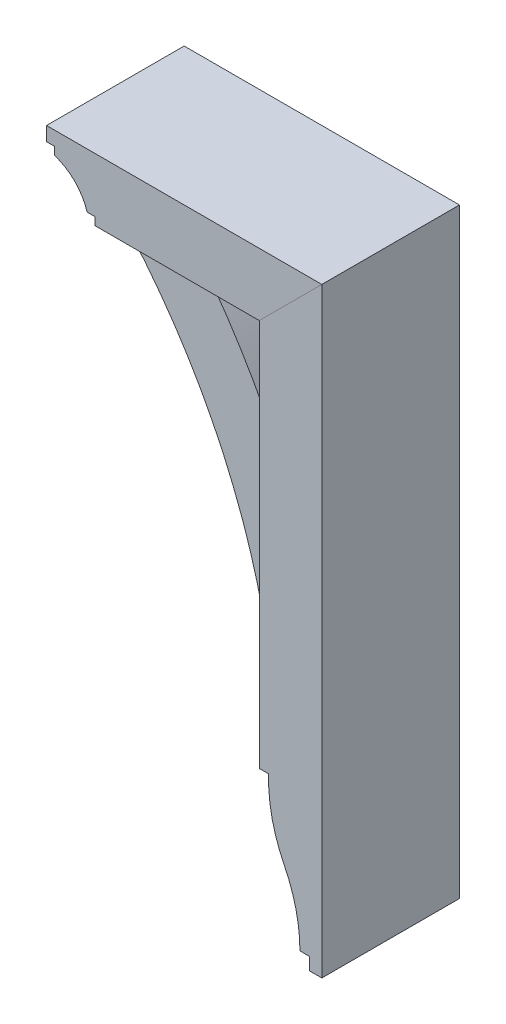
ISO-10303-21;
HEADER;
FILE_DESCRIPTION(('STEP AP214'),'2;1');
FILE_NAME('part.step','',(''),(''),'','','');
FILE_SCHEMA(('AUTOMOTIVE_DESIGN { 1 0 10303 214 1 1 1 1 }'));
ENDSEC;
DATA;
#1=APPLICATION_CONTEXT('core data for automotive mechanical design processes');
#2=APPLICATION_PROTOCOL_DEFINITION('international standard','automotive_design',2000,#1);
#3=PRODUCT_CONTEXT('',#1,'mechanical');
#4=PRODUCT('Part','Part','',(#3));
#5=PRODUCT_RELATED_PRODUCT_CATEGORY('part','',(#4));
#6=PRODUCT_DEFINITION_FORMATION('','',#4);
#7=PRODUCT_DEFINITION_CONTEXT('part definition',#1,'design');
#8=PRODUCT_DEFINITION('design','',#6,#7);
#9=PRODUCT_DEFINITION_SHAPE('','',#8);
#10=(LENGTH_UNIT() NAMED_UNIT(*) SI_UNIT(.MILLI.,.METRE.));
#11=(NAMED_UNIT(*) PLANE_ANGLE_UNIT() SI_UNIT($,.RADIAN.));
#12=(NAMED_UNIT(*) SI_UNIT($,.STERADIAN.) SOLID_ANGLE_UNIT());
#13=UNCERTAINTY_MEASURE_WITH_UNIT(LENGTH_MEASURE(1.E-05),#10,'distance_accuracy_value','');
#14=(GEOMETRIC_REPRESENTATION_CONTEXT(3) GLOBAL_UNCERTAINTY_ASSIGNED_CONTEXT((#13)) GLOBAL_UNIT_ASSIGNED_CONTEXT((#10,
#11,#12)) REPRESENTATION_CONTEXT('',''));
#15=CARTESIAN_POINT('',(0.,0.,0.));
#16=DIRECTION('',(0.,0.,1.));
#17=DIRECTION('',(1.,0.,0.));
#18=AXIS2_PLACEMENT_3D('',#15,#16,#17);
#19=CARTESIAN_POINT('',(0.,-183.515,69.85));
#20=DIRECTION('',(0.,1.,0.));
#21=DIRECTION('',(0.,0.,1.));
#22=AXIS2_PLACEMENT_3D('',#19,#20,#21);
#23=PLANE('',#22);
#24=DIRECTION('',(1.,0.,0.));
#25=VECTOR('',#24,1.);
#26=CARTESIAN_POINT('',(0.,-183.515,-69.85));
#27=LINE('',#26,#25);
#28=CARTESIAN_POINT('',(234.181223015556,-183.515,-69.85));
#29=VERTEX_POINT('',#28);
#30=CARTESIAN_POINT('',(243.706223015556,-183.515,-69.85));
#31=VERTEX_POINT('',#30);
#32=EDGE_CURVE('E170',#29,#31,#27,.T.);
#33=ORIENTED_EDGE('',*,*,#32,.T.);
#34=DIRECTION('',(0.,0.,-1.));
#35=VECTOR('',#34,1.);
#36=CARTESIAN_POINT('',(243.706223015556,-183.515,69.85));
#37=LINE('',#36,#35);
#38=CARTESIAN_POINT('',(243.706223015556,-183.515,69.85));
#39=VERTEX_POINT('',#38);
#40=EDGE_CURVE('E12',#39,#31,#37,.T.);
#41=ORIENTED_EDGE('',*,*,#40,.F.);
#42=DIRECTION('',(1.,0.,0.));
#43=VECTOR('',#42,1.);
#44=CARTESIAN_POINT('',(0.,-183.515,69.85));
#45=LINE('',#44,#43);
#46=CARTESIAN_POINT('',(234.181223015556,-183.515,69.85));
#47=VERTEX_POINT('',#46);
#48=EDGE_CURVE('E199',#47,#39,#45,.T.);
#49=ORIENTED_EDGE('',*,*,#48,.F.);
#50=DIRECTION('',(0.,0.,-1.));
#51=VECTOR('',#50,1.);
#52=CARTESIAN_POINT('',(234.181223015556,-183.515,69.85));
#53=LINE('',#52,#51);
#54=EDGE_CURVE('E166',#47,#29,#53,.T.);
#55=ORIENTED_EDGE('',*,*,#54,.T.);
#56=EDGE_LOOP('',(#33,#41,#49,#55));
#57=FACE_BOUND('',#56,.T.);
#58=ADVANCED_FACE('F60',(#57),#23,.F.);
#59=CARTESIAN_POINT('',(394.441019302061,-188.355593426,69.85));
#60=DIRECTION('',(0.,0.,-1.));
#61=DIRECTION('',(-1.,0.,0.));
#62=AXIS2_PLACEMENT_3D('',#59,#60,#61);
#63=CYLINDRICAL_SURFACE('',#62,150.8125);
#64=CARTESIAN_POINT('',(394.441019302061,-188.355593426,-69.85));
#65=DIRECTION('',(0.,0.,1.));
#66=DIRECTION('',(1.,0.,0.));
#67=AXIS2_PLACEMENT_3D('',#64,#65,#66);
#68=CIRCLE('',#67,150.8125);
#69=CARTESIAN_POINT('',(259.542371158808,-255.785296713,-69.85));
#70=VERTEX_POINT('',#69);
#71=EDGE_CURVE('E174',#31,#70,#68,.T.);
#72=ORIENTED_EDGE('',*,*,#71,.T.);
#73=DIRECTION('',(0.,0.,-1.));
#74=VECTOR('',#73,1.);
#75=CARTESIAN_POINT('',(259.542371158808,-255.785296713,69.85));
#76=LINE('',#75,#74);
#77=CARTESIAN_POINT('',(259.542371158808,-255.785296713,69.85));
#78=VERTEX_POINT('',#77);
#79=EDGE_CURVE('E69',#78,#70,#76,.T.);
#80=ORIENTED_EDGE('',*,*,#79,.F.);
#81=CARTESIAN_POINT('',(394.441019302061,-188.355593426,69.85));
#82=DIRECTION('',(0.,0.,1.));
#83=DIRECTION('',(1.,0.,0.));
#84=AXIS2_PLACEMENT_3D('',#81,#82,#83);
#85=CIRCLE('',#84,150.8125);
#86=EDGE_CURVE('E123',#39,#78,#85,.T.);
#87=ORIENTED_EDGE('',*,*,#86,.F.);
#88=ORIENTED_EDGE('',*,*,#40,.T.);
#89=EDGE_LOOP('',(#72,#80,#87,#88));
#90=FACE_BOUND('',#89,.T.);
#91=ADVANCED_FACE('F222',(#90),#63,.T.);
#92=CARTESIAN_POINT('',(124.643723015555,-323.215,69.85));
#93=DIRECTION('',(0.,0.,-1.));
#94=DIRECTION('',(-1.,0.,0.));
#95=AXIS2_PLACEMENT_3D('',#92,#93,#94);
#96=CYLINDRICAL_SURFACE('',#95,150.8125);
#97=CARTESIAN_POINT('',(124.643723015555,-323.215,-69.85));
#98=DIRECTION('',(0.,0.,1.));
#99=DIRECTION('',(1.,0.,0.));
#100=AXIS2_PLACEMENT_3D('',#97,#98,#99);
#101=CIRCLE('',#100,150.8125);
#102=CARTESIAN_POINT('',(275.456223015555,-323.215,-69.85));
#103=VERTEX_POINT('',#102);
#104=EDGE_CURVE('E177',#103,#70,#101,.T.);
#105=ORIENTED_EDGE('',*,*,#104,.F.);
#106=DIRECTION('',(0.,0.,-1.));
#107=VECTOR('',#106,1.);
#108=CARTESIAN_POINT('',(275.456223015555,-323.215,69.85));
#109=LINE('',#108,#107);
#110=CARTESIAN_POINT('',(275.456223015555,-323.215,69.85));
#111=VERTEX_POINT('',#110);
#112=EDGE_CURVE('E212',#111,#103,#109,.T.);
#113=ORIENTED_EDGE('',*,*,#112,.F.);
#114=CARTESIAN_POINT('',(124.643723015555,-323.215,69.85));
#115=DIRECTION('',(0.,0.,1.));
#116=DIRECTION('',(1.,0.,0.));
#117=AXIS2_PLACEMENT_3D('',#114,#115,#116);
#118=CIRCLE('',#117,150.8125);
#119=EDGE_CURVE('E221',#111,#78,#118,.T.);
#120=ORIENTED_EDGE('',*,*,#119,.T.);
#121=ORIENTED_EDGE('',*,*,#79,.T.);
#122=EDGE_LOOP('',(#105,#113,#120,#121));
#123=FACE_BOUND('',#122,.T.);
#124=ADVANCED_FACE('F219',(#123),#96,.F.);
#125=CARTESIAN_POINT('',(1.88367839844736E-12,-323.215000000002,69.85));
#126=DIRECTION('',(0.,-1.,0.));
#127=DIRECTION('',(1.,0.,0.));
#128=AXIS2_PLACEMENT_3D('',#125,#126,#127);
#129=PLANE('',#128);
#130=DIRECTION('',(-1.,0.,0.));
#131=VECTOR('',#130,1.);
#132=CARTESIAN_POINT('',(1.88367839844736E-12,-323.215000000002,-69.85));
#133=LINE('',#132,#131);
#134=CARTESIAN_POINT('',(284.981223015555,-323.215,-69.85));
#135=VERTEX_POINT('',#134);
#136=EDGE_CURVE('E181',#135,#103,#133,.T.);
#137=ORIENTED_EDGE('',*,*,#136,.F.);
#138=DIRECTION('',(0.,0.,-1.));
#139=VECTOR('',#138,1.);
#140=CARTESIAN_POINT('',(284.981223015555,-323.215,69.85));
#141=LINE('',#140,#139);
#142=CARTESIAN_POINT('',(284.981223015555,-323.215,69.85));
#143=VERTEX_POINT('',#142);
#144=EDGE_CURVE('E209',#143,#135,#141,.T.);
#145=ORIENTED_EDGE('',*,*,#144,.F.);
#146=DIRECTION('',(-1.,0.,0.));
#147=VECTOR('',#146,1.);
#148=CARTESIAN_POINT('',(1.88367839844736E-12,-323.215000000002,69.85));
#149=LINE('',#148,#147);
#150=EDGE_CURVE('E233',#143,#111,#149,.T.);
#151=ORIENTED_EDGE('',*,*,#150,.T.);
#152=ORIENTED_EDGE('',*,*,#112,.T.);
#153=EDGE_LOOP('',(#137,#145,#151,#152));
#154=FACE_BOUND('',#153,.T.);
#155=ADVANCED_FACE('F230',(#154),#129,.T.);
#156=CARTESIAN_POINT('',(284.981223015555,0.,69.85));
#157=DIRECTION('',(-1.,0.,0.));
#158=DIRECTION('',(0.,0.,1.));
#159=AXIS2_PLACEMENT_3D('',#156,#157,#158);
#160=PLANE('',#159);
#161=DIRECTION('',(0.,1.,0.));
#162=VECTOR('',#161,1.);
#163=CARTESIAN_POINT('',(284.981223015555,0.,-69.85));
#164=LINE('',#163,#162);
#165=CARTESIAN_POINT('',(284.981223015555,-335.915,-69.85));
#166=VERTEX_POINT('',#165);
#167=EDGE_CURVE('E185',#166,#135,#164,.T.);
#168=ORIENTED_EDGE('',*,*,#167,.F.);
#169=DIRECTION('',(0.,0.,-1.));
#170=VECTOR('',#169,1.);
#171=CARTESIAN_POINT('',(284.981223015555,-335.915,69.85));
#172=LINE('',#171,#170);
#173=CARTESIAN_POINT('',(284.981223015555,-335.915,69.85));
#174=VERTEX_POINT('',#173);
#175=EDGE_CURVE('E206',#174,#166,#172,.T.);
#176=ORIENTED_EDGE('',*,*,#175,.F.);
#177=DIRECTION('',(0.,1.,0.));
#178=VECTOR('',#177,1.);
#179=CARTESIAN_POINT('',(284.981223015555,0.,69.85));
#180=LINE('',#179,#178);
#181=EDGE_CURVE('E240',#174,#143,#180,.T.);
#182=ORIENTED_EDGE('',*,*,#181,.T.);
#183=ORIENTED_EDGE('',*,*,#144,.T.);
#184=EDGE_LOOP('',(#168,#176,#182,#183));
#185=FACE_BOUND('',#184,.T.);
#186=ADVANCED_FACE('F273',(#185),#160,.T.);
#187=CARTESIAN_POINT('',(0.,-335.915,69.85));
#188=DIRECTION('',(0.,-1.,0.));
#189=DIRECTION('',(0.,0.,-1.));
#190=AXIS2_PLACEMENT_3D('',#187,#188,#189);
#191=PLANE('',#190);
#192=DIRECTION('',(-1.,0.,0.));
#193=VECTOR('',#192,1.);
#194=CARTESIAN_POINT('',(0.,-335.915,-69.85));
#195=LINE('',#194,#193);
#196=CARTESIAN_POINT('',(297.681223015555,-335.915,-69.85));
#197=VERTEX_POINT('',#196);
#198=EDGE_CURVE('E189',#197,#166,#195,.T.);
#199=ORIENTED_EDGE('',*,*,#198,.F.);
#200=DIRECTION('',(0.,0.,-1.));
#201=VECTOR('',#200,1.);
#202=CARTESIAN_POINT('',(297.681223015555,-335.915,69.85));
#203=LINE('',#202,#201);
#204=CARTESIAN_POINT('',(297.681223015555,-335.915,69.85));
#205=VERTEX_POINT('',#204);
#206=EDGE_CURVE('E156',#205,#197,#203,.T.);
#207=ORIENTED_EDGE('',*,*,#206,.F.);
#208=DIRECTION('',(-1.,0.,0.));
#209=VECTOR('',#208,1.);
#210=CARTESIAN_POINT('',(0.,-335.915,69.85));
#211=LINE('',#210,#209);
#212=EDGE_CURVE('E147',#205,#174,#211,.T.);
#213=ORIENTED_EDGE('',*,*,#212,.T.);
#214=ORIENTED_EDGE('',*,*,#175,.T.);
#215=EDGE_LOOP('',(#199,#207,#213,#214));
#216=FACE_BOUND('',#215,.T.);
#217=ADVANCED_FACE('F249',(#216),#191,.T.);
#218=CARTESIAN_POINT('',(297.681223015555,0.,69.85));
#219=DIRECTION('',(-1.,0.,0.));
#220=DIRECTION('',(0.,-1.,0.));
#221=AXIS2_PLACEMENT_3D('',#218,#219,#220);
#222=PLANE('',#221);
#223=DIRECTION('',(0.,1.,0.));
#224=VECTOR('',#223,1.);
#225=CARTESIAN_POINT('',(297.681223015555,0.,-69.85));
#226=LINE('',#225,#224);
#227=CARTESIAN_POINT('',(297.681223015555,273.685,-69.85));
#228=VERTEX_POINT('',#227);
#229=EDGE_CURVE('E154',#197,#228,#226,.T.);
#230=ORIENTED_EDGE('',*,*,#229,.T.);
#231=DIRECTION('',(0.,0.,-1.));
#232=VECTOR('',#231,1.);
#233=CARTESIAN_POINT('',(297.681223015555,273.685,69.85));
#234=LINE('',#233,#232);
#235=CARTESIAN_POINT('',(297.681223015555,273.685,69.85));
#236=VERTEX_POINT('',#235);
#237=EDGE_CURVE('E151',#236,#228,#234,.T.);
#238=ORIENTED_EDGE('',*,*,#237,.F.);
#239=DIRECTION('',(0.,1.,0.));
#240=VECTOR('',#239,1.);
#241=CARTESIAN_POINT('',(297.681223015555,0.,69.85));
#242=LINE('',#241,#240);
#243=EDGE_CURVE('E140',#205,#236,#242,.T.);
#244=ORIENTED_EDGE('',*,*,#243,.F.);
#245=ORIENTED_EDGE('',*,*,#206,.T.);
#246=EDGE_LOOP('',(#230,#238,#244,#245));
#247=FACE_BOUND('',#246,.T.);
#248=ADVANCED_FACE('F152',(#247),#222,.F.);
#249=CARTESIAN_POINT('',(11.9981115077795,-11.9981115077793,69.85));
#250=DIRECTION('',(0.707106781186552,-0.707106781186543,0.));
#251=DIRECTION('',(0.707106781186543,0.707106781186552,0.));
#252=AXIS2_PLACEMENT_3D('',#249,#250,#251);
#253=PLANE('',#252);
#254=DIRECTION('',(-0.707106781186543,-0.707106781186552,0.));
#255=VECTOR('',#254,1.);
#256=CARTESIAN_POINT('',(11.9981115077795,-11.9981115077793,-69.85));
#257=LINE('',#256,#255);
#258=CARTESIAN_POINT('',(234.181223015556,210.185,-69.85));
#259=VERTEX_POINT('',#258);
#260=EDGE_CURVE('E109',#228,#259,#257,.T.);
#261=ORIENTED_EDGE('',*,*,#260,.T.);
#262=DIRECTION('',(0.,0.,-1.));
#263=VECTOR('',#262,1.);
#264=CARTESIAN_POINT('',(234.181223015556,210.185,69.85));
#265=LINE('',#264,#263);
#266=CARTESIAN_POINT('',(234.181223015556,210.185,69.85));
#267=VERTEX_POINT('',#266);
#268=EDGE_CURVE('E157',#267,#259,#265,.T.);
#269=ORIENTED_EDGE('',*,*,#268,.F.);
#270=DIRECTION('',(-0.707106781186543,-0.707106781186552,0.));
#271=VECTOR('',#270,1.);
#272=CARTESIAN_POINT('',(11.9981115077795,-11.9981115077793,69.85));
#273=LINE('',#272,#271);
#274=EDGE_CURVE('E144',#236,#267,#273,.T.);
#275=ORIENTED_EDGE('',*,*,#274,.F.);
#276=ORIENTED_EDGE('',*,*,#237,.T.);
#277=EDGE_LOOP('',(#261,#269,#275,#276));
#278=FACE_BOUND('',#277,.T.);
#279=ADVANCED_FACE('F159',(#278),#253,.F.);
#280=CARTESIAN_POINT('',(234.181223015556,0.,69.85));
#281=DIRECTION('',(1.,0.,0.));
#282=DIRECTION('',(0.,1.,0.));
#283=AXIS2_PLACEMENT_3D('',#280,#281,#282);
#284=PLANE('',#283);
#285=DIRECTION('',(0.,-1.,0.));
#286=VECTOR('',#285,1.);
#287=CARTESIAN_POINT('',(234.181223015556,0.,-69.85));
#288=LINE('',#287,#286);
#289=EDGE_CURVE('E115',#259,#29,#288,.T.);
#290=ORIENTED_EDGE('',*,*,#289,.T.);
#291=ORIENTED_EDGE('',*,*,#54,.F.);
#292=DIRECTION('',(0.,-1.,0.));
#293=VECTOR('',#292,1.);
#294=CARTESIAN_POINT('',(234.181223015556,0.,69.85));
#295=LINE('',#294,#293);
#296=EDGE_CURVE('E77',#267,#47,#295,.T.);
#297=ORIENTED_EDGE('',*,*,#296,.F.);
#298=ORIENTED_EDGE('',*,*,#268,.T.);
#299=EDGE_LOOP('',(#290,#291,#297,#298));
#300=FACE_BOUND('',#299,.T.);
#301=ADVANCED_FACE('F252',(#300),#284,.F.);
#302=CARTESIAN_POINT('',(0.,0.,69.85));
#303=DIRECTION('',(0.,0.,1.));
#304=DIRECTION('',(1.,0.,0.));
#305=AXIS2_PLACEMENT_3D('',#302,#303,#304);
#306=PLANE('',#305);
#307=ORIENTED_EDGE('',*,*,#48,.T.);
#308=ORIENTED_EDGE('',*,*,#86,.T.);
#309=ORIENTED_EDGE('',*,*,#119,.F.);
#310=ORIENTED_EDGE('',*,*,#150,.F.);
#311=ORIENTED_EDGE('',*,*,#181,.F.);
#312=ORIENTED_EDGE('',*,*,#212,.F.);
#313=ORIENTED_EDGE('',*,*,#243,.T.);
#314=ORIENTED_EDGE('',*,*,#274,.T.);
#315=ORIENTED_EDGE('',*,*,#296,.T.);
#316=EDGE_LOOP('',(#307,#308,#309,#310,#311,#312,#313,#314,#315));
#317=FACE_BOUND('',#316,.T.);
#318=ADVANCED_FACE('F142',(#317),#306,.T.);
#319=CARTESIAN_POINT('',(0.,0.,-69.85));
#320=DIRECTION('',(0.,0.,1.));
#321=DIRECTION('',(1.,0.,0.));
#322=AXIS2_PLACEMENT_3D('',#319,#320,#321);
#323=PLANE('',#322);
#324=ORIENTED_EDGE('',*,*,#32,.F.);
#325=ORIENTED_EDGE('',*,*,#289,.F.);
#326=ORIENTED_EDGE('',*,*,#260,.F.);
#327=ORIENTED_EDGE('',*,*,#229,.F.);
#328=ORIENTED_EDGE('',*,*,#198,.T.);
#329=ORIENTED_EDGE('',*,*,#167,.T.);
#330=ORIENTED_EDGE('',*,*,#136,.T.);
#331=ORIENTED_EDGE('',*,*,#104,.T.);
#332=ORIENTED_EDGE('',*,*,#71,.F.);
#333=EDGE_LOOP('',(#324,#325,#326,#327,#328,#329,#330,#331,#332));
#334=FACE_BOUND('',#333,.T.);
#335=ADVANCED_FACE('F226',(#334),#323,.F.);
#336=CLOSED_SHELL('',(#58,#91,#124,#155,#186,#217,#248,#279,#301,#318,#335));
#337=MANIFOLD_SOLID_BREP('B2',#336);
#338=CARTESIAN_POINT('',(-384.388411736873,-203.674659633313,44.45));
#339=DIRECTION('',(0.,0.,-1.));
#340=DIRECTION('',(-1.,0.,0.));
#341=AXIS2_PLACEMENT_3D('',#338,#339,#340);
#342=CYLINDRICAL_SURFACE('',#341,674.6875);
#343=CARTESIAN_POINT('',(-384.388411736873,-203.674659633313,-44.45));
#344=DIRECTION('',(0.,0.,1.));
#345=DIRECTION('',(1.,0.,0.));
#346=AXIS2_PLACEMENT_3D('',#343,#344,#345);
#347=CIRCLE('',#346,674.6875);
#348=CARTESIAN_POINT('',(148.456223015555,210.185,-44.45));
#349=VERTEX_POINT('',#348);
#350=CARTESIAN_POINT('',(234.181223015556,65.7224999999997,-44.45));
#351=VERTEX_POINT('',#350);
#352=EDGE_CURVE('E487',#349,#351,#347,.F.);
#353=ORIENTED_EDGE('',*,*,#352,.F.);
#354=DIRECTION('',(0.,0.,-1.));
#355=VECTOR('',#354,1.);
#356=CARTESIAN_POINT('',(148.456223015555,210.185,44.45));
#357=LINE('',#356,#355);
#358=CARTESIAN_POINT('',(148.456223015555,210.185,44.45));
#359=VERTEX_POINT('',#358);
#360=EDGE_CURVE('E58',#359,#349,#357,.T.);
#361=ORIENTED_EDGE('',*,*,#360,.F.);
#362=CARTESIAN_POINT('',(-384.388411736873,-203.674659633313,44.45));
#363=DIRECTION('',(0.,0.,1.));
#364=DIRECTION('',(1.,0.,0.));
#365=AXIS2_PLACEMENT_3D('',#362,#363,#364);
#366=CIRCLE('',#365,674.6875);
#367=CARTESIAN_POINT('',(234.181223015556,65.7224999999997,44.45));
#368=VERTEX_POINT('',#367);
#369=EDGE_CURVE('E506',#359,#368,#366,.F.);
#370=ORIENTED_EDGE('',*,*,#369,.T.);
#371=DIRECTION('',(0.,0.,-1.));
#372=VECTOR('',#371,1.);
#373=CARTESIAN_POINT('',(234.181223015556,65.7224999999997,44.45));
#374=LINE('',#373,#372);
#375=EDGE_CURVE('E416',#368,#351,#374,.T.);
#376=ORIENTED_EDGE('',*,*,#375,.T.);
#377=EDGE_LOOP('',(#353,#361,#370,#376));
#378=FACE_BOUND('',#377,.T.);
#379=ADVANCED_FACE('F399',(#378),#342,.T.);
#380=CARTESIAN_POINT('',(-1.04995377471693E-13,210.185,44.45));
#381=DIRECTION('',(0.,1.,0.));
#382=DIRECTION('',(-1.,0.,0.));
#383=AXIS2_PLACEMENT_3D('',#380,#381,#382);
#384=PLANE('',#383);
#385=DIRECTION('',(1.,0.,0.));
#386=VECTOR('',#385,1.);
#387=CARTESIAN_POINT('',(-1.04995377471693E-13,210.185,-44.45));
#388=LINE('',#387,#386);
#389=CARTESIAN_POINT('',(77.018723015555,210.185,-44.45));
#390=VERTEX_POINT('',#389);
#391=EDGE_CURVE('E490',#390,#349,#388,.T.);
#392=ORIENTED_EDGE('',*,*,#391,.F.);
#393=DIRECTION('',(0.,0.,-1.));
#394=VECTOR('',#393,1.);
#395=CARTESIAN_POINT('',(77.018723015555,210.185,44.45));
#396=LINE('',#395,#394);
#397=CARTESIAN_POINT('',(77.018723015555,210.185,44.45));
#398=VERTEX_POINT('',#397);
#399=EDGE_CURVE('E408',#398,#390,#396,.T.);
#400=ORIENTED_EDGE('',*,*,#399,.F.);
#401=DIRECTION('',(1.,0.,0.));
#402=VECTOR('',#401,1.);
#403=CARTESIAN_POINT('',(-1.04995377471693E-13,210.185,44.45));
#404=LINE('',#403,#402);
#405=EDGE_CURVE('E522',#398,#359,#404,.T.);
#406=ORIENTED_EDGE('',*,*,#405,.T.);
#407=ORIENTED_EDGE('',*,*,#360,.T.);
#408=EDGE_LOOP('',(#392,#400,#406,#407));
#409=FACE_BOUND('',#408,.T.);
#410=ADVANCED_FACE('F521',(#409),#384,.T.);
#411=CARTESIAN_POINT('',(77.0187230155555,1.68322755155703E-13,44.45));
#412=DIRECTION('',(1.,0.,0.));
#413=DIRECTION('',(0.,1.,0.));
#414=AXIS2_PLACEMENT_3D('',#411,#412,#413);
#415=PLANE('',#414);
#416=DIRECTION('',(0.,-1.,0.));
#417=VECTOR('',#416,1.);
#418=CARTESIAN_POINT('',(77.0187230155555,1.68322755155703E-13,-44.45));
#419=LINE('',#418,#417);
#420=CARTESIAN_POINT('',(77.018723015555,197.485,-44.45));
#421=VERTEX_POINT('',#420);
#422=EDGE_CURVE('E494',#390,#421,#419,.T.);
#423=ORIENTED_EDGE('',*,*,#422,.T.);
#424=DIRECTION('',(0.,0.,-1.));
#425=VECTOR('',#424,1.);
#426=CARTESIAN_POINT('',(77.018723015555,197.485,44.45));
#427=LINE('',#426,#425);
#428=CARTESIAN_POINT('',(77.018723015555,197.485,44.45));
#429=VERTEX_POINT('',#428);
#430=EDGE_CURVE('E476',#429,#421,#427,.T.);
#431=ORIENTED_EDGE('',*,*,#430,.F.);
#432=DIRECTION('',(0.,-1.,0.));
#433=VECTOR('',#432,1.);
#434=CARTESIAN_POINT('',(77.0187230155555,1.68322755155703E-13,44.45));
#435=LINE('',#434,#433);
#436=EDGE_CURVE('E462',#398,#429,#435,.T.);
#437=ORIENTED_EDGE('',*,*,#436,.F.);
#438=ORIENTED_EDGE('',*,*,#399,.T.);
#439=EDGE_LOOP('',(#423,#431,#437,#438));
#440=FACE_BOUND('',#439,.T.);
#441=ADVANCED_FACE('F515',(#440),#415,.F.);
#442=CARTESIAN_POINT('',(-383.927755161358,-203.860866320497,44.45));
#443=DIRECTION('',(0.,0.,-1.));
#444=DIRECTION('',(-1.,0.,0.));
#445=AXIS2_PLACEMENT_3D('',#442,#443,#444);
#446=CYLINDRICAL_SURFACE('',#445,611.1875);
#447=CARTESIAN_POINT('',(-383.927755161358,-203.860866320497,-44.45));
#448=DIRECTION('',(0.,0.,1.));
#449=DIRECTION('',(1.,0.,0.));
#450=AXIS2_PLACEMENT_3D('',#447,#448,#449);
#451=CIRCLE('',#450,611.1875);
#452=CARTESIAN_POINT('',(221.481223015556,-120.015,-44.45));
#453=VERTEX_POINT('',#452);
#454=EDGE_CURVE('E472',#421,#453,#451,.F.);
#455=ORIENTED_EDGE('',*,*,#454,.T.);
#456=DIRECTION('',(0.,0.,-1.));
#457=VECTOR('',#456,1.);
#458=CARTESIAN_POINT('',(221.481223015556,-120.015,44.45));
#459=LINE('',#458,#457);
#460=CARTESIAN_POINT('',(221.481223015556,-120.015,44.45));
#461=VERTEX_POINT('',#460);
#462=EDGE_CURVE('E469',#461,#453,#459,.T.);
#463=ORIENTED_EDGE('',*,*,#462,.F.);
#464=CARTESIAN_POINT('',(-383.927755161358,-203.860866320497,44.45));
#465=DIRECTION('',(0.,0.,1.));
#466=DIRECTION('',(1.,0.,0.));
#467=AXIS2_PLACEMENT_3D('',#464,#465,#466);
#468=CIRCLE('',#467,611.1875);
#469=EDGE_CURVE('E454',#429,#461,#468,.F.);
#470=ORIENTED_EDGE('',*,*,#469,.F.);
#471=ORIENTED_EDGE('',*,*,#430,.T.);
#472=EDGE_LOOP('',(#455,#463,#470,#471));
#473=FACE_BOUND('',#472,.T.);
#474=ADVANCED_FACE('F470',(#473),#446,.F.);
#475=CARTESIAN_POINT('',(1.31145094783847E-13,-120.015,44.45));
#476=DIRECTION('',(0.,-1.,0.));
#477=DIRECTION('',(1.,0.,0.));
#478=AXIS2_PLACEMENT_3D('',#475,#476,#477);
#479=PLANE('',#478);
#480=DIRECTION('',(-1.,0.,0.));
#481=VECTOR('',#480,1.);
#482=CARTESIAN_POINT('',(1.31145094783847E-13,-120.015,-44.45));
#483=LINE('',#482,#481);
#484=CARTESIAN_POINT('',(234.181223015556,-120.015,-44.45));
#485=VERTEX_POINT('',#484);
#486=EDGE_CURVE('E499',#485,#453,#483,.T.);
#487=ORIENTED_EDGE('',*,*,#486,.F.);
#488=DIRECTION('',(0.,0.,-1.));
#489=VECTOR('',#488,1.);
#490=CARTESIAN_POINT('',(234.181223015556,-120.015,44.45));
#491=LINE('',#490,#489);
#492=CARTESIAN_POINT('',(234.181223015556,-120.015,44.45));
#493=VERTEX_POINT('',#492);
#494=EDGE_CURVE('E435',#493,#485,#491,.T.);
#495=ORIENTED_EDGE('',*,*,#494,.F.);
#496=DIRECTION('',(-1.,0.,0.));
#497=VECTOR('',#496,1.);
#498=CARTESIAN_POINT('',(1.31145094783847E-13,-120.015,44.45));
#499=LINE('',#498,#497);
#500=EDGE_CURVE('E459',#493,#461,#499,.T.);
#501=ORIENTED_EDGE('',*,*,#500,.T.);
#502=ORIENTED_EDGE('',*,*,#462,.T.);
#503=EDGE_LOOP('',(#487,#495,#501,#502));
#504=FACE_BOUND('',#503,.T.);
#505=ADVANCED_FACE('F478',(#504),#479,.T.);
#506=CARTESIAN_POINT('',(234.181223015556,0.,44.45));
#507=DIRECTION('',(1.,0.,0.));
#508=DIRECTION('',(0.,1.,0.));
#509=AXIS2_PLACEMENT_3D('',#506,#507,#508);
#510=PLANE('',#509);
#511=DIRECTION('',(0.,-1.,0.));
#512=VECTOR('',#511,1.);
#513=CARTESIAN_POINT('',(234.181223015556,0.,-44.45));
#514=LINE('',#513,#512);
#515=EDGE_CURVE('E502',#351,#485,#514,.T.);
#516=ORIENTED_EDGE('',*,*,#515,.F.);
#517=ORIENTED_EDGE('',*,*,#375,.F.);
#518=DIRECTION('',(0.,-1.,0.));
#519=VECTOR('',#518,1.);
#520=CARTESIAN_POINT('',(234.181223015556,0.,44.45));
#521=LINE('',#520,#519);
#522=EDGE_CURVE('E480',#368,#493,#521,.T.);
#523=ORIENTED_EDGE('',*,*,#522,.T.);
#524=ORIENTED_EDGE('',*,*,#494,.T.);
#525=EDGE_LOOP('',(#516,#517,#523,#524));
#526=FACE_BOUND('',#525,.T.);
#527=ADVANCED_FACE('F523',(#526),#510,.T.);
#528=CARTESIAN_POINT('',(0.,0.,44.45));
#529=DIRECTION('',(0.,0.,1.));
#530=DIRECTION('',(1.,0.,0.));
#531=AXIS2_PLACEMENT_3D('',#528,#529,#530);
#532=PLANE('',#531);
#533=ORIENTED_EDGE('',*,*,#369,.F.);
#534=ORIENTED_EDGE('',*,*,#405,.F.);
#535=ORIENTED_EDGE('',*,*,#436,.T.);
#536=ORIENTED_EDGE('',*,*,#469,.T.);
#537=ORIENTED_EDGE('',*,*,#500,.F.);
#538=ORIENTED_EDGE('',*,*,#522,.F.);
#539=EDGE_LOOP('',(#533,#534,#535,#536,#537,#538));
#540=FACE_BOUND('',#539,.T.);
#541=ADVANCED_FACE('F456',(#540),#532,.T.);
#542=CARTESIAN_POINT('',(0.,0.,-44.45));
#543=DIRECTION('',(0.,0.,1.));
#544=DIRECTION('',(1.,0.,0.));
#545=AXIS2_PLACEMENT_3D('',#542,#543,#544);
#546=PLANE('',#545);
#547=ORIENTED_EDGE('',*,*,#352,.T.);
#548=ORIENTED_EDGE('',*,*,#515,.T.);
#549=ORIENTED_EDGE('',*,*,#486,.T.);
#550=ORIENTED_EDGE('',*,*,#454,.F.);
#551=ORIENTED_EDGE('',*,*,#422,.F.);
#552=ORIENTED_EDGE('',*,*,#391,.T.);
#553=EDGE_LOOP('',(#547,#548,#549,#550,#551,#552));
#554=FACE_BOUND('',#553,.T.);
#555=ADVANCED_FACE('F520',(#554),#546,.F.);
#556=CLOSED_SHELL('',(#379,#410,#441,#474,#505,#527,#541,#555));
#557=MANIFOLD_SOLID_BREP('B6',#556);
#558=CARTESIAN_POINT('',(26.2187230155549,0.,69.85));
#559=DIRECTION('',(-1.,0.,0.));
#560=DIRECTION('',(0.,-1.,0.));
#561=AXIS2_PLACEMENT_3D('',#558,#559,#560);
#562=PLANE('',#561);
#563=DIRECTION('',(0.,1.,0.));
#564=VECTOR('',#563,1.);
#565=CARTESIAN_POINT('',(26.2187230155549,0.,-69.85));
#566=LINE('',#565,#564);
#567=CARTESIAN_POINT('',(26.218723015555,251.46,-69.85));
#568=VERTEX_POINT('',#567);
#569=CARTESIAN_POINT('',(26.218723015555,259.3975,-69.85));
#570=VERTEX_POINT('',#569);
#571=EDGE_CURVE('E714',#568,#570,#566,.T.);
#572=ORIENTED_EDGE('',*,*,#571,.F.);
#573=DIRECTION('',(0.,0.,-1.));
#574=VECTOR('',#573,1.);
#575=CARTESIAN_POINT('',(26.218723015555,251.46,69.85));
#576=LINE('',#575,#574);
#577=CARTESIAN_POINT('',(26.218723015555,251.46,69.85));
#578=VERTEX_POINT('',#577);
#579=EDGE_CURVE('E397',#578,#568,#576,.T.);
#580=ORIENTED_EDGE('',*,*,#579,.F.);
#581=DIRECTION('',(0.,1.,0.));
#582=VECTOR('',#581,1.);
#583=CARTESIAN_POINT('',(26.2187230155549,0.,69.85));
#584=LINE('',#583,#582);
#585=CARTESIAN_POINT('',(26.218723015555,259.3975,69.85));
#586=VERTEX_POINT('',#585);
#587=EDGE_CURVE('E746',#578,#586,#584,.T.);
#588=ORIENTED_EDGE('',*,*,#587,.T.);
#589=DIRECTION('',(0.,0.,-1.));
#590=VECTOR('',#589,1.);
#591=CARTESIAN_POINT('',(26.218723015555,259.3975,69.85));
#592=LINE('',#591,#590);
#593=EDGE_CURVE('E626',#586,#570,#592,.T.);
#594=ORIENTED_EDGE('',*,*,#593,.T.);
#595=EDGE_LOOP('',(#572,#580,#588,#594));
#596=FACE_BOUND('',#595,.T.);
#597=ADVANCED_FACE('F609',(#596),#562,.T.);
#598=CARTESIAN_POINT('',(11.1212597180008,203.025036702446,69.85));
#599=DIRECTION('',(0.,0.,-1.));
#600=DIRECTION('',(-1.,0.,0.));
#601=AXIS2_PLACEMENT_3D('',#598,#599,#600);
#602=CYLINDRICAL_SURFACE('',#601,50.7334117486338);
#603=CARTESIAN_POINT('',(11.1212597180008,203.025036702446,-69.85));
#604=DIRECTION('',(0.,0.,1.));
#605=DIRECTION('',(1.,0.,0.));
#606=AXIS2_PLACEMENT_3D('',#603,#604,#605);
#607=CIRCLE('',#606,50.7334117486338);
#608=CARTESIAN_POINT('',(59.556223015555,218.1225,-69.85));
#609=VERTEX_POINT('',#608);
#610=EDGE_CURVE('E717',#568,#609,#607,.F.);
#611=ORIENTED_EDGE('',*,*,#610,.T.);
#612=DIRECTION('',(0.,0.,-1.));
#613=VECTOR('',#612,1.);
#614=CARTESIAN_POINT('',(59.556223015555,218.1225,69.85));
#615=LINE('',#614,#613);
#616=CARTESIAN_POINT('',(59.556223015555,218.1225,69.85));
#617=VERTEX_POINT('',#616);
#618=EDGE_CURVE('E618',#617,#609,#615,.T.);
#619=ORIENTED_EDGE('',*,*,#618,.F.);
#620=CARTESIAN_POINT('',(11.1212597180008,203.025036702446,69.85));
#621=DIRECTION('',(0.,0.,1.));
#622=DIRECTION('',(1.,0.,0.));
#623=AXIS2_PLACEMENT_3D('',#620,#621,#622);
#624=CIRCLE('',#623,50.7334117486338);
#625=EDGE_CURVE('E781',#578,#617,#624,.F.);
#626=ORIENTED_EDGE('',*,*,#625,.F.);
#627=ORIENTED_EDGE('',*,*,#579,.T.);
#628=EDGE_LOOP('',(#611,#619,#626,#627));
#629=FACE_BOUND('',#628,.T.);
#630=ADVANCED_FACE('F770',(#629),#602,.F.);
#631=CARTESIAN_POINT('',(7.62723217917483E-13,218.1225,69.85));
#632=DIRECTION('',(0.,-1.,0.));
#633=DIRECTION('',(1.,0.,0.));
#634=AXIS2_PLACEMENT_3D('',#631,#632,#633);
#635=PLANE('',#634);
#636=DIRECTION('',(-1.,0.,0.));
#637=VECTOR('',#636,1.);
#638=CARTESIAN_POINT('',(7.62723217917483E-13,218.1225,-69.85));
#639=LINE('',#638,#637);
#640=CARTESIAN_POINT('',(67.493723015555,218.1225,-69.85));
#641=VERTEX_POINT('',#640);
#642=EDGE_CURVE('E721',#641,#609,#639,.T.);
#643=ORIENTED_EDGE('',*,*,#642,.F.);
#644=DIRECTION('',(0.,0.,-1.));
#645=VECTOR('',#644,1.);
#646=CARTESIAN_POINT('',(67.493723015555,218.1225,69.85));
#647=LINE('',#646,#645);
#648=CARTESIAN_POINT('',(67.493723015555,218.1225,69.85));
#649=VERTEX_POINT('',#648);
#650=EDGE_CURVE('E758',#649,#641,#647,.T.);
#651=ORIENTED_EDGE('',*,*,#650,.F.);
#652=DIRECTION('',(-1.,0.,0.));
#653=VECTOR('',#652,1.);
#654=CARTESIAN_POINT('',(7.62723217917483E-13,218.1225,69.85));
#655=LINE('',#654,#653);
#656=EDGE_CURVE('E767',#649,#617,#655,.T.);
#657=ORIENTED_EDGE('',*,*,#656,.T.);
#658=ORIENTED_EDGE('',*,*,#618,.T.);
#659=EDGE_LOOP('',(#643,#651,#657,#658));
#660=FACE_BOUND('',#659,.T.);
#661=ADVANCED_FACE('F765',(#660),#635,.T.);
#662=CARTESIAN_POINT('',(67.4937230155554,1.18004858755185E-13,69.85));
#663=DIRECTION('',(-1.,0.,0.));
#664=DIRECTION('',(0.,-1.,0.));
#665=AXIS2_PLACEMENT_3D('',#662,#663,#664);
#666=PLANE('',#665);
#667=DIRECTION('',(0.,1.,0.));
#668=VECTOR('',#667,1.);
#669=CARTESIAN_POINT('',(67.4937230155554,1.18004858755185E-13,-69.85));
#670=LINE('',#669,#668);
#671=CARTESIAN_POINT('',(67.493723015555,210.185,-69.85));
#672=VERTEX_POINT('',#671);
#673=EDGE_CURVE('E725',#672,#641,#670,.T.);
#674=ORIENTED_EDGE('',*,*,#673,.F.);
#675=DIRECTION('',(0.,0.,-1.));
#676=VECTOR('',#675,1.);
#677=CARTESIAN_POINT('',(67.493723015555,210.185,69.85));
#678=LINE('',#677,#676);
#679=CARTESIAN_POINT('',(67.493723015555,210.185,69.85));
#680=VERTEX_POINT('',#679);
#681=EDGE_CURVE('E756',#680,#672,#678,.T.);
#682=ORIENTED_EDGE('',*,*,#681,.F.);
#683=DIRECTION('',(0.,1.,0.));
#684=VECTOR('',#683,1.);
#685=CARTESIAN_POINT('',(67.4937230155554,1.18004858755185E-13,69.85));
#686=LINE('',#685,#684);
#687=EDGE_CURVE('E780',#680,#649,#686,.T.);
#688=ORIENTED_EDGE('',*,*,#687,.T.);
#689=ORIENTED_EDGE('',*,*,#650,.T.);
#690=EDGE_LOOP('',(#674,#682,#688,#689));
#691=FACE_BOUND('',#690,.T.);
#692=ADVANCED_FACE('F776',(#691),#666,.T.);
#693=CARTESIAN_POINT('',(-1.04995377471693E-13,210.185,69.85));
#694=DIRECTION('',(0.,1.,0.));
#695=DIRECTION('',(-1.,0.,0.));
#696=AXIS2_PLACEMENT_3D('',#693,#694,#695);
#697=PLANE('',#696);
#698=DIRECTION('',(1.,0.,0.));
#699=VECTOR('',#698,1.);
#700=CARTESIAN_POINT('',(-1.04995377471693E-13,210.185,-69.85));
#701=LINE('',#700,#699);
#702=CARTESIAN_POINT('',(234.181223015556,210.185,-69.85));
#703=VERTEX_POINT('',#702);
#704=EDGE_CURVE('E729',#672,#703,#701,.T.);
#705=ORIENTED_EDGE('',*,*,#704,.T.);
#706=DIRECTION('',(0.,0.,-1.));
#707=VECTOR('',#706,1.);
#708=CARTESIAN_POINT('',(234.181223015556,210.185,69.85));
#709=LINE('',#708,#707);
#710=CARTESIAN_POINT('',(234.181223015556,210.185,69.85));
#711=VERTEX_POINT('',#710);
#712=EDGE_CURVE('E753',#711,#703,#709,.T.);
#713=ORIENTED_EDGE('',*,*,#712,.F.);
#714=DIRECTION('',(1.,0.,0.));
#715=VECTOR('',#714,1.);
#716=CARTESIAN_POINT('',(-1.04995377471693E-13,210.185,69.85));
#717=LINE('',#716,#715);
#718=EDGE_CURVE('E786',#680,#711,#717,.T.);
#719=ORIENTED_EDGE('',*,*,#718,.F.);
#720=ORIENTED_EDGE('',*,*,#681,.T.);
#721=EDGE_LOOP('',(#705,#713,#719,#720));
#722=FACE_BOUND('',#721,.T.);
#723=ADVANCED_FACE('F818',(#722),#697,.F.);
#724=CARTESIAN_POINT('',(11.9981115077795,-11.9981115077793,69.85));
#725=DIRECTION('',(0.707106781186552,-0.707106781186543,0.));
#726=DIRECTION('',(0.707106781186543,0.707106781186552,0.));
#727=AXIS2_PLACEMENT_3D('',#724,#725,#726);
#728=PLANE('',#727);
#729=DIRECTION('',(-0.707106781186543,-0.707106781186552,0.));
#730=VECTOR('',#729,1.);
#731=CARTESIAN_POINT('',(11.9981115077795,-11.9981115077793,-69.85));
#732=LINE('',#731,#730);
#733=CARTESIAN_POINT('',(297.681223015555,273.685,-69.85));
#734=VERTEX_POINT('',#733);
#735=EDGE_CURVE('E733',#734,#703,#732,.T.);
#736=ORIENTED_EDGE('',*,*,#735,.F.);
#737=DIRECTION('',(0.,0.,-1.));
#738=VECTOR('',#737,1.);
#739=CARTESIAN_POINT('',(297.681223015555,273.685,69.85));
#740=LINE('',#739,#738);
#741=CARTESIAN_POINT('',(297.681223015555,273.685,69.85));
#742=VERTEX_POINT('',#741);
#743=EDGE_CURVE('E703',#742,#734,#740,.T.);
#744=ORIENTED_EDGE('',*,*,#743,.F.);
#745=DIRECTION('',(-0.707106781186543,-0.707106781186552,0.));
#746=VECTOR('',#745,1.);
#747=CARTESIAN_POINT('',(11.9981115077795,-11.9981115077793,69.85));
#748=LINE('',#747,#746);
#749=EDGE_CURVE('E691',#742,#711,#748,.T.);
#750=ORIENTED_EDGE('',*,*,#749,.T.);
#751=ORIENTED_EDGE('',*,*,#712,.T.);
#752=EDGE_LOOP('',(#736,#744,#750,#751));
#753=FACE_BOUND('',#752,.T.);
#754=ADVANCED_FACE('F795',(#753),#728,.T.);
#755=CARTESIAN_POINT('',(0.,273.685,69.85));
#756=DIRECTION('',(0.,-1.,0.));
#757=DIRECTION('',(0.,0.,-1.));
#758=AXIS2_PLACEMENT_3D('',#755,#756,#757);
#759=PLANE('',#758);
#760=DIRECTION('',(-1.,0.,0.));
#761=VECTOR('',#760,1.);
#762=CARTESIAN_POINT('',(0.,273.685,-69.85));
#763=LINE('',#762,#761);
#764=CARTESIAN_POINT('',(18.281223015555,273.685,-69.85));
#765=VERTEX_POINT('',#764);
#766=EDGE_CURVE('E699',#734,#765,#763,.T.);
#767=ORIENTED_EDGE('',*,*,#766,.T.);
#768=DIRECTION('',(0.,0.,-1.));
#769=VECTOR('',#768,1.);
#770=CARTESIAN_POINT('',(18.281223015555,273.685,69.85));
#771=LINE('',#770,#769);
#772=CARTESIAN_POINT('',(18.281223015555,273.685,69.85));
#773=VERTEX_POINT('',#772);
#774=EDGE_CURVE('E696',#773,#765,#771,.T.);
#775=ORIENTED_EDGE('',*,*,#774,.F.);
#776=DIRECTION('',(-1.,0.,0.));
#777=VECTOR('',#776,1.);
#778=CARTESIAN_POINT('',(0.,273.685,69.85));
#779=LINE('',#778,#777);
#780=EDGE_CURVE('E683',#742,#773,#779,.T.);
#781=ORIENTED_EDGE('',*,*,#780,.F.);
#782=ORIENTED_EDGE('',*,*,#743,.T.);
#783=EDGE_LOOP('',(#767,#775,#781,#782));
#784=FACE_BOUND('',#783,.T.);
#785=ADVANCED_FACE('F697',(#784),#759,.F.);
#786=CARTESIAN_POINT('',(18.281223015555,0.,69.85));
#787=DIRECTION('',(1.,0.,0.));
#788=DIRECTION('',(0.,0.,-1.));
#789=AXIS2_PLACEMENT_3D('',#786,#787,#788);
#790=PLANE('',#789);
#791=DIRECTION('',(0.,-1.,0.));
#792=VECTOR('',#791,1.);
#793=CARTESIAN_POINT('',(18.281223015555,0.,-69.85));
#794=LINE('',#793,#792);
#795=CARTESIAN_POINT('',(18.281223015555,259.3975,-69.85));
#796=VERTEX_POINT('',#795);
#797=EDGE_CURVE('E739',#765,#796,#794,.T.);
#798=ORIENTED_EDGE('',*,*,#797,.T.);
#799=DIRECTION('',(0.,0.,-1.));
#800=VECTOR('',#799,1.);
#801=CARTESIAN_POINT('',(18.281223015555,259.3975,69.85));
#802=LINE('',#801,#800);
#803=CARTESIAN_POINT('',(18.281223015555,259.3975,69.85));
#804=VERTEX_POINT('',#803);
#805=EDGE_CURVE('E655',#804,#796,#802,.T.);
#806=ORIENTED_EDGE('',*,*,#805,.F.);
#807=DIRECTION('',(0.,-1.,0.));
#808=VECTOR('',#807,1.);
#809=CARTESIAN_POINT('',(18.281223015555,0.,69.85));
#810=LINE('',#809,#808);
#811=EDGE_CURVE('E689',#773,#804,#810,.T.);
#812=ORIENTED_EDGE('',*,*,#811,.F.);
#813=ORIENTED_EDGE('',*,*,#774,.T.);
#814=EDGE_LOOP('',(#798,#806,#812,#813));
#815=FACE_BOUND('',#814,.T.);
#816=ADVANCED_FACE('F705',(#815),#790,.F.);
#817=CARTESIAN_POINT('',(0.,259.3975,69.85));
#818=DIRECTION('',(0.,-1.,0.));
#819=DIRECTION('',(0.,0.,-1.));
#820=AXIS2_PLACEMENT_3D('',#817,#818,#819);
#821=PLANE('',#820);
#822=DIRECTION('',(-1.,0.,0.));
#823=VECTOR('',#822,1.);
#824=CARTESIAN_POINT('',(0.,259.3975,-69.85));
#825=LINE('',#824,#823);
#826=EDGE_CURVE('E742',#570,#796,#825,.T.);
#827=ORIENTED_EDGE('',*,*,#826,.F.);
#828=ORIENTED_EDGE('',*,*,#593,.F.);
#829=DIRECTION('',(-1.,0.,0.));
#830=VECTOR('',#829,1.);
#831=CARTESIAN_POINT('',(0.,259.3975,69.85));
#832=LINE('',#831,#830);
#833=EDGE_CURVE('E707',#586,#804,#832,.T.);
#834=ORIENTED_EDGE('',*,*,#833,.T.);
#835=ORIENTED_EDGE('',*,*,#805,.T.);
#836=EDGE_LOOP('',(#827,#828,#834,#835));
#837=FACE_BOUND('',#836,.T.);
#838=ADVANCED_FACE('F797',(#837),#821,.T.);
#839=CARTESIAN_POINT('',(0.,0.,69.85));
#840=DIRECTION('',(0.,0.,1.));
#841=DIRECTION('',(1.,0.,0.));
#842=AXIS2_PLACEMENT_3D('',#839,#840,#841);
#843=PLANE('',#842);
#844=ORIENTED_EDGE('',*,*,#587,.F.);
#845=ORIENTED_EDGE('',*,*,#625,.T.);
#846=ORIENTED_EDGE('',*,*,#656,.F.);
#847=ORIENTED_EDGE('',*,*,#687,.F.);
#848=ORIENTED_EDGE('',*,*,#718,.T.);
#849=ORIENTED_EDGE('',*,*,#749,.F.);
#850=ORIENTED_EDGE('',*,*,#780,.T.);
#851=ORIENTED_EDGE('',*,*,#811,.T.);
#852=ORIENTED_EDGE('',*,*,#833,.F.);
#853=EDGE_LOOP('',(#844,#845,#846,#847,#848,#849,#850,#851,#852));
#854=FACE_BOUND('',#853,.T.);
#855=ADVANCED_FACE('F686',(#854),#843,.T.);
#856=CARTESIAN_POINT('',(0.,0.,-69.85));
#857=DIRECTION('',(0.,0.,1.));
#858=DIRECTION('',(1.,0.,0.));
#859=AXIS2_PLACEMENT_3D('',#856,#857,#858);
#860=PLANE('',#859);
#861=ORIENTED_EDGE('',*,*,#571,.T.);
#862=ORIENTED_EDGE('',*,*,#826,.T.);
#863=ORIENTED_EDGE('',*,*,#797,.F.);
#864=ORIENTED_EDGE('',*,*,#766,.F.);
#865=ORIENTED_EDGE('',*,*,#735,.T.);
#866=ORIENTED_EDGE('',*,*,#704,.F.);
#867=ORIENTED_EDGE('',*,*,#673,.T.);
#868=ORIENTED_EDGE('',*,*,#642,.T.);
#869=ORIENTED_EDGE('',*,*,#610,.F.);
#870=EDGE_LOOP('',(#861,#862,#863,#864,#865,#866,#867,#868,#869));
#871=FACE_BOUND('',#870,.T.);
#872=ADVANCED_FACE('F772',(#871),#860,.F.);
#873=CLOSED_SHELL('',(#597,#630,#661,#692,#723,#754,#785,#816,#838,#855,#872));
#874=MANIFOLD_SOLID_BREP('B52',#873);
#875=ADVANCED_BREP_SHAPE_REPRESENTATION('',(#18,#337,#557,#874),#14);
#876=SHAPE_DEFINITION_REPRESENTATION(#9,#875);
ENDSEC;
END-ISO-10303-21;
